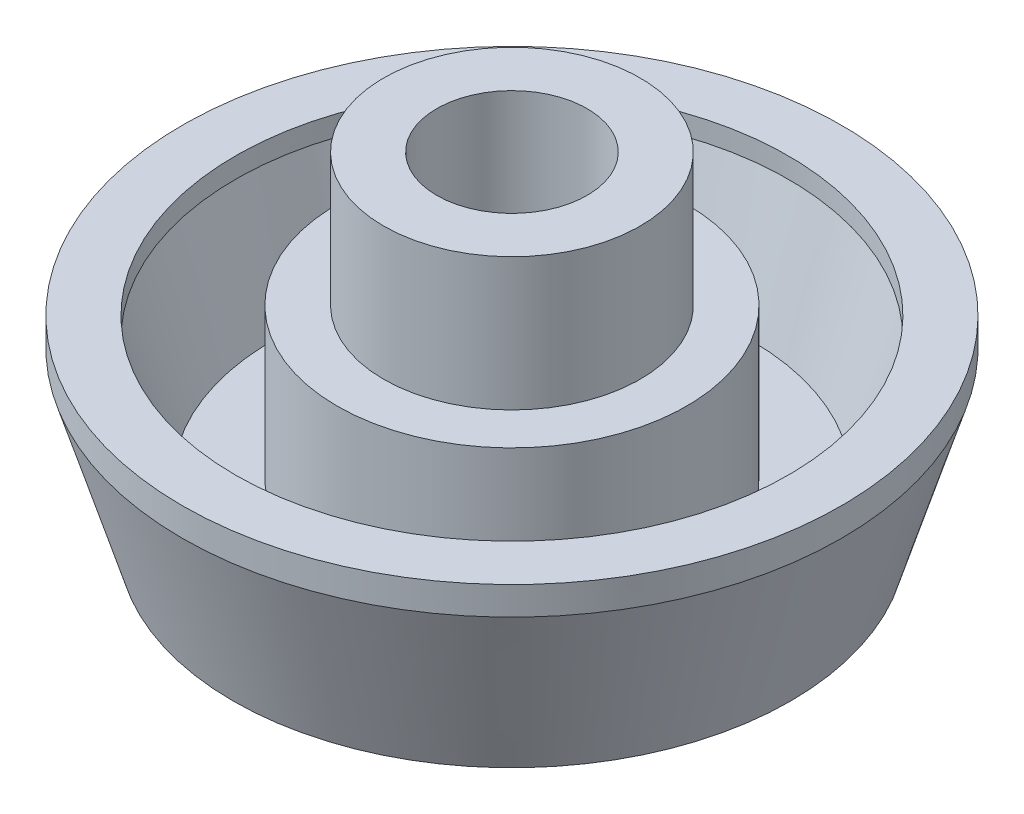
ISO-10303-21;
HEADER;
FILE_DESCRIPTION(('STEP AP214'),'2;1');
FILE_NAME('part.step','',(''),(''),'','','');
FILE_SCHEMA(('AUTOMOTIVE_DESIGN { 1 0 10303 214 1 1 1 1 }'));
ENDSEC;
DATA;
#1=APPLICATION_CONTEXT('core data for automotive mechanical design processes');
#2=APPLICATION_PROTOCOL_DEFINITION('international standard','automotive_design',2000,#1);
#3=PRODUCT_CONTEXT('',#1,'mechanical');
#4=PRODUCT('Part','Part','',(#3));
#5=PRODUCT_RELATED_PRODUCT_CATEGORY('part','',(#4));
#6=PRODUCT_DEFINITION_FORMATION('','',#4);
#7=PRODUCT_DEFINITION_CONTEXT('part definition',#1,'design');
#8=PRODUCT_DEFINITION('design','',#6,#7);
#9=PRODUCT_DEFINITION_SHAPE('','',#8);
#10=(LENGTH_UNIT() NAMED_UNIT(*) SI_UNIT(.MILLI.,.METRE.));
#11=(NAMED_UNIT(*) PLANE_ANGLE_UNIT() SI_UNIT($,.RADIAN.));
#12=(NAMED_UNIT(*) SI_UNIT($,.STERADIAN.) SOLID_ANGLE_UNIT());
#13=UNCERTAINTY_MEASURE_WITH_UNIT(LENGTH_MEASURE(1.E-05),#10,'distance_accuracy_value','');
#14=(GEOMETRIC_REPRESENTATION_CONTEXT(3) GLOBAL_UNCERTAINTY_ASSIGNED_CONTEXT((#13)) GLOBAL_UNIT_ASSIGNED_CONTEXT((#10,
#11,#12)) REPRESENTATION_CONTEXT('',''));
#15=CARTESIAN_POINT('',(0.,0.,0.));
#16=DIRECTION('',(0.,0.,1.));
#17=DIRECTION('',(1.,0.,0.));
#18=AXIS2_PLACEMENT_3D('',#15,#16,#17);
#19=CARTESIAN_POINT('',(0.,0.,0.));
#20=DIRECTION('',(0.,1.,0.));
#21=DIRECTION('',(0.,0.,1.));
#22=AXIS2_PLACEMENT_3D('',#19,#20,#21);
#23=PLANE('',#22);
#24=CARTESIAN_POINT('',(0.,0.,0.));
#25=DIRECTION('',(0.,-1.,0.));
#26=DIRECTION('',(0.,0.,-1.));
#27=AXIS2_PLACEMENT_3D('',#24,#25,#26);
#28=CIRCLE('',#27,2.95);
#29=CARTESIAN_POINT('',(0.,0.,-2.95));
#30=VERTEX_POINT('',#29);
#31=EDGE_CURVE('E80',#30,#30,#28,.T.);
#32=ORIENTED_EDGE('',*,*,#31,.F.);
#33=EDGE_LOOP('',(#32));
#34=FACE_BOUND('',#33,.T.);
#35=CARTESIAN_POINT('',(0.,0.,0.));
#36=DIRECTION('',(0.,-1.,0.));
#37=DIRECTION('',(0.,0.,-1.));
#38=AXIS2_PLACEMENT_3D('',#35,#36,#37);
#39=CIRCLE('',#38,6.3);
#40=CARTESIAN_POINT('',(0.,0.,-6.3));
#41=VERTEX_POINT('',#40);
#42=EDGE_CURVE('E74',#41,#41,#39,.T.);
#43=ORIENTED_EDGE('',*,*,#42,.T.);
#44=EDGE_LOOP('',(#43));
#45=FACE_BOUND('',#44,.T.);
#46=ADVANCED_FACE('F42',(#34,#45),#23,.F.);
#47=CARTESIAN_POINT('',(0.,3.4,0.));
#48=DIRECTION('',(0.,-1.,0.));
#49=DIRECTION('',(0.,0.,-1.));
#50=AXIS2_PLACEMENT_3D('',#47,#48,#49);
#51=CYLINDRICAL_SURFACE('',#50,2.95);
#52=CARTESIAN_POINT('',(0.,3.4,0.));
#53=DIRECTION('',(0.,-1.,0.));
#54=DIRECTION('',(0.,0.,-1.));
#55=AXIS2_PLACEMENT_3D('',#52,#53,#54);
#56=CIRCLE('',#55,2.95);
#57=CARTESIAN_POINT('',(0.,3.4,-2.95));
#58=VERTEX_POINT('',#57);
#59=EDGE_CURVE('E54',#58,#58,#56,.T.);
#60=ORIENTED_EDGE('',*,*,#59,.F.);
#61=EDGE_LOOP('',(#60));
#62=FACE_BOUND('',#61,.T.);
#63=ORIENTED_EDGE('',*,*,#31,.T.);
#64=EDGE_LOOP('',(#63));
#65=FACE_BOUND('',#64,.T.);
#66=ADVANCED_FACE('F85',(#62,#65),#51,.F.);
#67=CARTESIAN_POINT('',(0.,3.4,0.));
#68=DIRECTION('',(0.,-1.,0.));
#69=DIRECTION('',(0.,0.,-1.));
#70=AXIS2_PLACEMENT_3D('',#67,#68,#69);
#71=PLANE('',#70);
#72=ORIENTED_EDGE('',*,*,#59,.T.);
#73=EDGE_LOOP('',(#72));
#74=FACE_BOUND('',#73,.T.);
#75=ADVANCED_FACE('F95',(#74),#71,.T.);
#76=CARTESIAN_POINT('',(0.,0.,0.));
#77=DIRECTION('',(0.,1.,0.));
#78=DIRECTION('',(0.,0.,-1.));
#79=AXIS2_PLACEMENT_3D('',#76,#77,#78);
#80=CONICAL_SURFACE('',#79,6.3,0.296705972839037);
#81=ORIENTED_EDGE('',*,*,#42,.F.);
#82=EDGE_LOOP('',(#81));
#83=FACE_BOUND('',#82,.T.);
#84=CARTESIAN_POINT('',(0.,3.76148051125675,0.));
#85=DIRECTION('',(0.,1.,0.));
#86=DIRECTION('',(0.,0.,1.));
#87=AXIS2_PLACEMENT_3D('',#84,#85,#86);
#88=CIRCLE('',#87,7.45);
#89=CARTESIAN_POINT('',(0.,3.76148051125675,7.45));
#90=VERTEX_POINT('',#89);
#91=EDGE_CURVE('E77',#90,#90,#88,.F.);
#92=ORIENTED_EDGE('',*,*,#91,.T.);
#93=EDGE_LOOP('',(#92));
#94=FACE_BOUND('',#93,.T.);
#95=ADVANCED_FACE('F91',(#83,#94),#80,.T.);
#96=CARTESIAN_POINT('',(0.,4.4,0.));
#97=DIRECTION('',(0.,1.,0.));
#98=DIRECTION('',(0.,0.,1.));
#99=AXIS2_PLACEMENT_3D('',#96,#97,#98);
#100=PLANE('',#99);
#101=CARTESIAN_POINT('',(0.,4.4,0.));
#102=DIRECTION('',(0.,1.,0.));
#103=DIRECTION('',(0.,0.,1.));
#104=AXIS2_PLACEMENT_3D('',#101,#102,#103);
#105=CIRCLE('',#104,6.25);
#106=CARTESIAN_POINT('',(0.,4.4,6.25));
#107=VERTEX_POINT('',#106);
#108=EDGE_CURVE('E71',#107,#107,#105,.T.);
#109=ORIENTED_EDGE('',*,*,#108,.F.);
#110=EDGE_LOOP('',(#109));
#111=FACE_BOUND('',#110,.T.);
#112=CARTESIAN_POINT('',(0.,4.4,0.));
#113=DIRECTION('',(0.,1.,0.));
#114=DIRECTION('',(0.,0.,1.));
#115=AXIS2_PLACEMENT_3D('',#112,#113,#114);
#116=CIRCLE('',#115,7.45);
#117=CARTESIAN_POINT('',(0.,4.4,7.45));
#118=VERTEX_POINT('',#117);
#119=EDGE_CURVE('E46',#118,#118,#116,.T.);
#120=ORIENTED_EDGE('',*,*,#119,.T.);
#121=EDGE_LOOP('',(#120));
#122=FACE_BOUND('',#121,.T.);
#123=ADVANCED_FACE('F94',(#111,#122),#100,.T.);
#124=CARTESIAN_POINT('',(0.,4.4,0.));
#125=DIRECTION('',(0.,-1.,0.));
#126=DIRECTION('',(0.,0.,-1.));
#127=AXIS2_PLACEMENT_3D('',#124,#125,#126);
#128=CYLINDRICAL_SURFACE('',#127,7.45);
#129=ORIENTED_EDGE('',*,*,#119,.F.);
#130=EDGE_LOOP('',(#129));
#131=FACE_BOUND('',#130,.T.);
#132=ORIENTED_EDGE('',*,*,#91,.F.);
#133=EDGE_LOOP('',(#132));
#134=FACE_BOUND('',#133,.T.);
#135=ADVANCED_FACE('F44',(#131,#134),#128,.T.);
#136=CARTESIAN_POINT('',(0.,1.2,0.));
#137=DIRECTION('',(0.,1.,0.));
#138=DIRECTION('',(0.,0.,1.));
#139=AXIS2_PLACEMENT_3D('',#136,#137,#138);
#140=PLANE('',#139);
#141=CARTESIAN_POINT('',(0.,1.2,0.));
#142=DIRECTION('',(0.,1.,0.));
#143=DIRECTION('',(0.,0.,1.));
#144=AXIS2_PLACEMENT_3D('',#141,#142,#143);
#145=CIRCLE('',#144,5.41204670996582);
#146=CARTESIAN_POINT('',(0.,1.2,5.41204670996582));
#147=VERTEX_POINT('',#146);
#148=EDGE_CURVE('E62',#147,#147,#145,.F.);
#149=ORIENTED_EDGE('',*,*,#148,.F.);
#150=EDGE_LOOP('',(#149));
#151=FACE_BOUND('',#150,.T.);
#152=CARTESIAN_POINT('',(0.,1.2,0.));
#153=DIRECTION('',(0.,1.,0.));
#154=DIRECTION('',(0.,0.,1.));
#155=AXIS2_PLACEMENT_3D('',#152,#153,#154);
#156=CIRCLE('',#155,3.95);
#157=CARTESIAN_POINT('',(0.,1.2,3.95));
#158=VERTEX_POINT('',#157);
#159=EDGE_CURVE('E63',#158,#158,#156,.F.);
#160=ORIENTED_EDGE('',*,*,#159,.T.);
#161=EDGE_LOOP('',(#160));
#162=FACE_BOUND('',#161,.T.);
#163=ADVANCED_FACE('F100',(#151,#162),#140,.T.);
#164=CARTESIAN_POINT('',(0.,0.350846045667285,0.));
#165=DIRECTION('',(0.,1.,0.));
#166=DIRECTION('',(0.,0.,-1.));
#167=AXIS2_PLACEMENT_3D('',#164,#165,#166);
#168=CONICAL_SURFACE('',#167,5.15243429284436,0.296705972839037);
#169=ORIENTED_EDGE('',*,*,#148,.T.);
#170=EDGE_LOOP('',(#169));
#171=FACE_BOUND('',#170,.T.);
#172=CARTESIAN_POINT('',(0.,3.9408217128757,0.));
#173=DIRECTION('',(0.,1.,0.));
#174=DIRECTION('',(0.,0.,1.));
#175=AXIS2_PLACEMENT_3D('',#172,#173,#174);
#176=CIRCLE('',#175,6.25);
#177=CARTESIAN_POINT('',(0.,3.9408217128757,6.25));
#178=VERTEX_POINT('',#177);
#179=EDGE_CURVE('E68',#178,#178,#176,.F.);
#180=ORIENTED_EDGE('',*,*,#179,.F.);
#181=EDGE_LOOP('',(#180));
#182=FACE_BOUND('',#181,.T.);
#183=ADVANCED_FACE('F106',(#171,#182),#168,.F.);
#184=CARTESIAN_POINT('',(0.,4.4,0.));
#185=DIRECTION('',(0.,-1.,0.));
#186=DIRECTION('',(0.,0.,-1.));
#187=AXIS2_PLACEMENT_3D('',#184,#185,#186);
#188=CYLINDRICAL_SURFACE('',#187,6.25);
#189=ORIENTED_EDGE('',*,*,#108,.T.);
#190=EDGE_LOOP('',(#189));
#191=FACE_BOUND('',#190,.T.);
#192=ORIENTED_EDGE('',*,*,#179,.T.);
#193=EDGE_LOOP('',(#192));
#194=FACE_BOUND('',#193,.T.);
#195=ADVANCED_FACE('F123',(#191,#194),#188,.F.);
#196=CARTESIAN_POINT('',(0.,-10.5379725676967,0.));
#197=DIRECTION('',(0.,1.,0.));
#198=DIRECTION('',(0.,0.,1.));
#199=AXIS2_PLACEMENT_3D('',#196,#197,#198);
#200=CYLINDRICAL_SURFACE('',#199,3.95);
#201=ORIENTED_EDGE('',*,*,#159,.F.);
#202=EDGE_LOOP('',(#201));
#203=FACE_BOUND('',#202,.T.);
#204=CARTESIAN_POINT('',(0.,4.6,0.));
#205=DIRECTION('',(0.,1.,0.));
#206=DIRECTION('',(0.,0.,1.));
#207=AXIS2_PLACEMENT_3D('',#204,#205,#206);
#208=CIRCLE('',#207,3.95);
#209=CARTESIAN_POINT('',(0.,4.6,3.95));
#210=VERTEX_POINT('',#209);
#211=EDGE_CURVE('E59',#210,#210,#208,.T.);
#212=ORIENTED_EDGE('',*,*,#211,.F.);
#213=EDGE_LOOP('',(#212));
#214=FACE_BOUND('',#213,.T.);
#215=ADVANCED_FACE('F126',(#203,#214),#200,.T.);
#216=CARTESIAN_POINT('',(0.,4.6,0.));
#217=DIRECTION('',(0.,-1.,0.));
#218=DIRECTION('',(0.,0.,-1.));
#219=AXIS2_PLACEMENT_3D('',#216,#217,#218);
#220=PLANE('',#219);
#221=CARTESIAN_POINT('',(0.,4.6,0.));
#222=DIRECTION('',(0.,1.,0.));
#223=DIRECTION('',(0.,0.,1.));
#224=AXIS2_PLACEMENT_3D('',#221,#222,#223);
#225=CIRCLE('',#224,2.9);
#226=CARTESIAN_POINT('',(0.,4.6,2.9));
#227=VERTEX_POINT('',#226);
#228=EDGE_CURVE('E11',#227,#227,#225,.T.);
#229=ORIENTED_EDGE('',*,*,#228,.F.);
#230=EDGE_LOOP('',(#229));
#231=FACE_BOUND('',#230,.T.);
#232=ORIENTED_EDGE('',*,*,#211,.T.);
#233=EDGE_LOOP('',(#232));
#234=FACE_BOUND('',#233,.T.);
#235=ADVANCED_FACE('F131',(#231,#234),#220,.F.);
#236=CARTESIAN_POINT('',(0.,7.6,0.));
#237=DIRECTION('',(0.,-1.,0.));
#238=DIRECTION('',(0.,0.,-1.));
#239=AXIS2_PLACEMENT_3D('',#236,#237,#238);
#240=CYLINDRICAL_SURFACE('',#239,2.9);
#241=CARTESIAN_POINT('',(0.,7.6,0.));
#242=DIRECTION('',(0.,1.,0.));
#243=DIRECTION('',(0.,0.,1.));
#244=AXIS2_PLACEMENT_3D('',#241,#242,#243);
#245=CIRCLE('',#244,2.9);
#246=CARTESIAN_POINT('',(0.,7.6,2.9));
#247=VERTEX_POINT('',#246);
#248=EDGE_CURVE('E57',#247,#247,#245,.T.);
#249=ORIENTED_EDGE('',*,*,#248,.F.);
#250=EDGE_LOOP('',(#249));
#251=FACE_BOUND('',#250,.T.);
#252=ORIENTED_EDGE('',*,*,#228,.T.);
#253=EDGE_LOOP('',(#252));
#254=FACE_BOUND('',#253,.T.);
#255=ADVANCED_FACE('F133',(#251,#254),#240,.T.);
#256=CARTESIAN_POINT('',(0.,7.6,0.));
#257=DIRECTION('',(0.,1.,0.));
#258=DIRECTION('',(0.,0.,1.));
#259=AXIS2_PLACEMENT_3D('',#256,#257,#258);
#260=PLANE('',#259);
#261=CARTESIAN_POINT('',(0.,7.6,0.));
#262=DIRECTION('',(0.,1.,0.));
#263=DIRECTION('',(0.,0.,1.));
#264=AXIS2_PLACEMENT_3D('',#261,#262,#263);
#265=CIRCLE('',#264,1.7);
#266=CARTESIAN_POINT('',(0.,7.6,1.7));
#267=VERTEX_POINT('',#266);
#268=EDGE_CURVE('E158',#267,#267,#265,.T.);
#269=ORIENTED_EDGE('',*,*,#268,.F.);
#270=EDGE_LOOP('',(#269));
#271=FACE_BOUND('',#270,.T.);
#272=ORIENTED_EDGE('',*,*,#248,.T.);
#273=EDGE_LOOP('',(#272));
#274=FACE_BOUND('',#273,.T.);
#275=ADVANCED_FACE('F141',(#271,#274),#260,.T.);
#276=CARTESIAN_POINT('',(0.,4.3,0.));
#277=DIRECTION('',(0.,1.,0.));
#278=DIRECTION('',(0.,0.,1.));
#279=AXIS2_PLACEMENT_3D('',#276,#277,#278);
#280=CYLINDRICAL_SURFACE('',#279,1.7);
#281=CARTESIAN_POINT('',(0.,4.3,0.));
#282=DIRECTION('',(0.,1.,0.));
#283=DIRECTION('',(0.,0.,1.));
#284=AXIS2_PLACEMENT_3D('',#281,#282,#283);
#285=CIRCLE('',#284,1.7);
#286=CARTESIAN_POINT('',(0.,4.3,1.7));
#287=VERTEX_POINT('',#286);
#288=EDGE_CURVE('E157',#287,#287,#285,.T.);
#289=ORIENTED_EDGE('',*,*,#288,.F.);
#290=EDGE_LOOP('',(#289));
#291=FACE_BOUND('',#290,.T.);
#292=ORIENTED_EDGE('',*,*,#268,.T.);
#293=EDGE_LOOP('',(#292));
#294=FACE_BOUND('',#293,.T.);
#295=ADVANCED_FACE('F145',(#291,#294),#280,.F.);
#296=CARTESIAN_POINT('',(0.,4.3,0.));
#297=DIRECTION('',(0.,1.,0.));
#298=DIRECTION('',(0.,0.,1.));
#299=AXIS2_PLACEMENT_3D('',#296,#297,#298);
#300=PLANE('',#299);
#301=ORIENTED_EDGE('',*,*,#288,.T.);
#302=EDGE_LOOP('',(#301));
#303=FACE_BOUND('',#302,.T.);
#304=ADVANCED_FACE('F149',(#303),#300,.T.);
#305=CLOSED_SHELL('',(#46,#66,#75,#95,#123,#135,#163,#183,#195,#215,#235,#255,#275,#295,#304));
#306=MANIFOLD_SOLID_BREP('B2',#305);
#307=ADVANCED_BREP_SHAPE_REPRESENTATION('',(#18,#306),#14);
#308=SHAPE_DEFINITION_REPRESENTATION(#9,#307);
ENDSEC;
END-ISO-10303-21;
